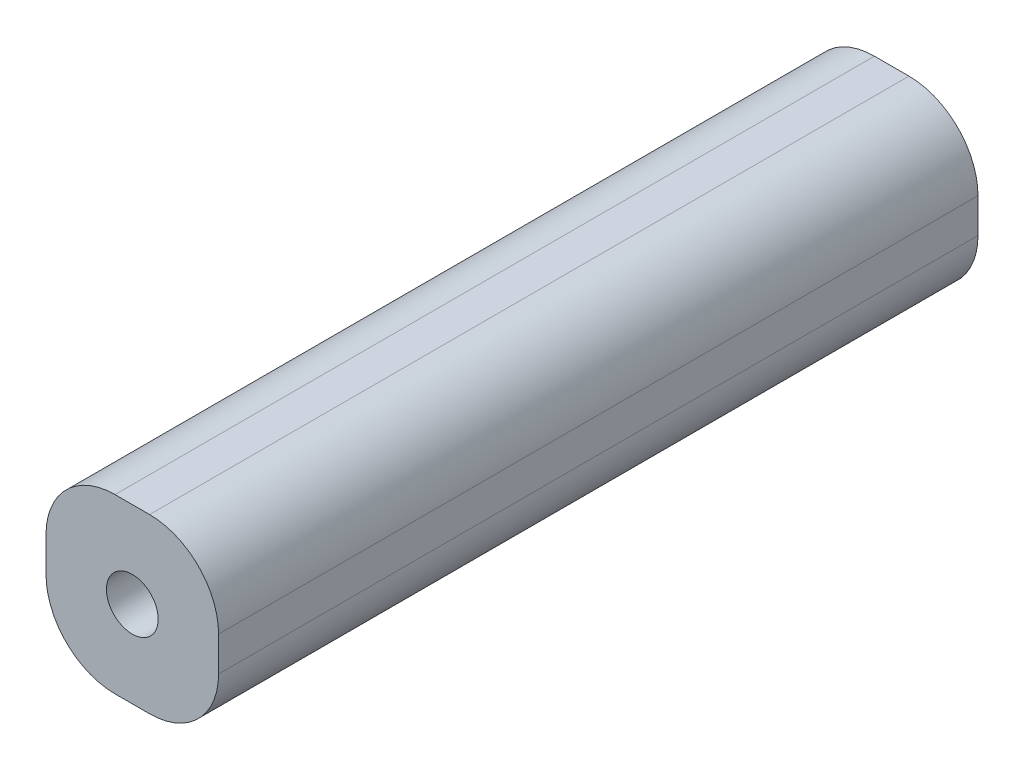
ISO-10303-21;
HEADER;
FILE_DESCRIPTION(('STEP AP214'),'2;1');
FILE_NAME('part.step','',(''),(''),'','','');
FILE_SCHEMA(('AUTOMOTIVE_DESIGN { 1 0 10303 214 1 1 1 1 }'));
ENDSEC;
DATA;
#1=APPLICATION_CONTEXT('core data for automotive mechanical design processes');
#2=APPLICATION_PROTOCOL_DEFINITION('international standard','automotive_design',2000,#1);
#3=PRODUCT_CONTEXT('',#1,'mechanical');
#4=PRODUCT('Part','Part','',(#3));
#5=PRODUCT_RELATED_PRODUCT_CATEGORY('part','',(#4));
#6=PRODUCT_DEFINITION_FORMATION('','',#4);
#7=PRODUCT_DEFINITION_CONTEXT('part definition',#1,'design');
#8=PRODUCT_DEFINITION('design','',#6,#7);
#9=PRODUCT_DEFINITION_SHAPE('','',#8);
#10=(LENGTH_UNIT() NAMED_UNIT(*) SI_UNIT(.MILLI.,.METRE.));
#11=(NAMED_UNIT(*) PLANE_ANGLE_UNIT() SI_UNIT($,.RADIAN.));
#12=(NAMED_UNIT(*) SI_UNIT($,.STERADIAN.) SOLID_ANGLE_UNIT());
#13=UNCERTAINTY_MEASURE_WITH_UNIT(LENGTH_MEASURE(1.E-05),#10,'distance_accuracy_value','');
#14=(GEOMETRIC_REPRESENTATION_CONTEXT(3) GLOBAL_UNCERTAINTY_ASSIGNED_CONTEXT((#13)) GLOBAL_UNIT_ASSIGNED_CONTEXT((#10,
#11,#12)) REPRESENTATION_CONTEXT('',''));
#15=CARTESIAN_POINT('',(0.,0.,0.));
#16=DIRECTION('',(0.,0.,1.));
#17=DIRECTION('',(1.,0.,0.));
#18=AXIS2_PLACEMENT_3D('',#15,#16,#17);
#19=CARTESIAN_POINT('',(0.,0.,44.));
#20=DIRECTION('',(0.,0.,1.));
#21=DIRECTION('',(1.,0.,0.));
#22=AXIS2_PLACEMENT_3D('',#19,#20,#21);
#23=PLANE('',#22);
#24=DIRECTION('',(0.,-1.,0.));
#25=VECTOR('',#24,1.);
#26=CARTESIAN_POINT('',(-6.28000000000001,7.34,44.));
#27=LINE('',#26,#25);
#28=CARTESIAN_POINT('',(-6.28000000000001,3.34,44.));
#29=VERTEX_POINT('',#28);
#30=CARTESIAN_POINT('',(-6.28000000000001,1.34,44.));
#31=VERTEX_POINT('',#30);
#32=EDGE_CURVE('E180',#29,#31,#27,.T.);
#33=ORIENTED_EDGE('',*,*,#32,.T.);
#34=CARTESIAN_POINT('',(-2.28000000000001,1.34,44.));
#35=DIRECTION('',(0.,0.,1.));
#36=DIRECTION('',(1.,0.,0.));
#37=AXIS2_PLACEMENT_3D('',#34,#35,#36);
#38=CIRCLE('',#37,4.);
#39=CARTESIAN_POINT('',(-2.28000000000001,-2.66,44.));
#40=VERTEX_POINT('',#39);
#41=EDGE_CURVE('E168',#31,#40,#38,.T.);
#42=ORIENTED_EDGE('',*,*,#41,.T.);
#43=DIRECTION('',(1.,0.,0.));
#44=VECTOR('',#43,1.);
#45=CARTESIAN_POINT('',(-6.28000000000001,-2.66,44.));
#46=LINE('',#45,#44);
#47=CARTESIAN_POINT('',(-0.280000000000007,-2.66,44.));
#48=VERTEX_POINT('',#47);
#49=EDGE_CURVE('E126',#40,#48,#46,.T.);
#50=ORIENTED_EDGE('',*,*,#49,.T.);
#51=CARTESIAN_POINT('',(-0.280000000000007,1.34,44.));
#52=DIRECTION('',(0.,0.,1.));
#53=DIRECTION('',(1.,0.,0.));
#54=AXIS2_PLACEMENT_3D('',#51,#52,#53);
#55=CIRCLE('',#54,4.);
#56=CARTESIAN_POINT('',(3.71999999999999,1.34,44.));
#57=VERTEX_POINT('',#56);
#58=EDGE_CURVE('E165',#48,#57,#55,.T.);
#59=ORIENTED_EDGE('',*,*,#58,.T.);
#60=DIRECTION('',(0.,1.,0.));
#61=VECTOR('',#60,1.);
#62=CARTESIAN_POINT('',(3.71999999999999,7.34,44.));
#63=LINE('',#62,#61);
#64=CARTESIAN_POINT('',(3.71999999999999,3.34,44.));
#65=VERTEX_POINT('',#64);
#66=EDGE_CURVE('E135',#57,#65,#63,.T.);
#67=ORIENTED_EDGE('',*,*,#66,.T.);
#68=CARTESIAN_POINT('',(-0.280000000000007,3.34,44.));
#69=DIRECTION('',(0.,0.,1.));
#70=DIRECTION('',(1.,0.,0.));
#71=AXIS2_PLACEMENT_3D('',#68,#69,#70);
#72=CIRCLE('',#71,4.);
#73=CARTESIAN_POINT('',(-0.280000000000007,7.34,44.));
#74=VERTEX_POINT('',#73);
#75=EDGE_CURVE('E60',#65,#74,#72,.T.);
#76=ORIENTED_EDGE('',*,*,#75,.T.);
#77=DIRECTION('',(-1.,0.,0.));
#78=VECTOR('',#77,1.);
#79=CARTESIAN_POINT('',(-6.28000000000001,7.34,44.));
#80=LINE('',#79,#78);
#81=CARTESIAN_POINT('',(-2.28000000000001,7.34,44.));
#82=VERTEX_POINT('',#81);
#83=EDGE_CURVE('E140',#74,#82,#80,.T.);
#84=ORIENTED_EDGE('',*,*,#83,.T.);
#85=CARTESIAN_POINT('',(-2.28000000000001,3.34,44.));
#86=DIRECTION('',(0.,0.,1.));
#87=DIRECTION('',(1.,0.,0.));
#88=AXIS2_PLACEMENT_3D('',#85,#86,#87);
#89=CIRCLE('',#88,4.);
#90=EDGE_CURVE('E160',#82,#29,#89,.T.);
#91=ORIENTED_EDGE('',*,*,#90,.T.);
#92=EDGE_LOOP('',(#33,#42,#50,#59,#67,#76,#84,#91));
#93=FACE_BOUND('',#92,.T.);
#94=CARTESIAN_POINT('',(-1.28000000000001,2.34,44.));
#95=DIRECTION('',(0.,0.,1.));
#96=DIRECTION('',(1.,0.,0.));
#97=AXIS2_PLACEMENT_3D('',#94,#95,#96);
#98=CIRCLE('',#97,1.5);
#99=CARTESIAN_POINT('',(0.219999999999993,2.34,44.));
#100=VERTEX_POINT('',#99);
#101=EDGE_CURVE('E192',#100,#100,#98,.T.);
#102=ORIENTED_EDGE('',*,*,#101,.F.);
#103=EDGE_LOOP('',(#102));
#104=FACE_BOUND('',#103,.T.);
#105=ADVANCED_FACE('F38',(#93,#104),#23,.T.);
#106=CARTESIAN_POINT('',(0.,0.,0.));
#107=DIRECTION('',(0.,0.,1.));
#108=DIRECTION('',(1.,0.,0.));
#109=AXIS2_PLACEMENT_3D('',#106,#107,#108);
#110=PLANE('',#109);
#111=DIRECTION('',(1.,0.,0.));
#112=VECTOR('',#111,1.);
#113=CARTESIAN_POINT('',(-6.28000000000001,-2.66,0.));
#114=LINE('',#113,#112);
#115=CARTESIAN_POINT('',(-2.28000000000001,-2.66,0.));
#116=VERTEX_POINT('',#115);
#117=CARTESIAN_POINT('',(-0.280000000000007,-2.66,0.));
#118=VERTEX_POINT('',#117);
#119=EDGE_CURVE('E123',#116,#118,#114,.T.);
#120=ORIENTED_EDGE('',*,*,#119,.F.);
#121=CARTESIAN_POINT('',(-2.28000000000001,1.34,0.));
#122=DIRECTION('',(0.,0.,1.));
#123=DIRECTION('',(1.,0.,0.));
#124=AXIS2_PLACEMENT_3D('',#121,#122,#123);
#125=CIRCLE('',#124,4.);
#126=CARTESIAN_POINT('',(-6.28000000000001,1.34,0.));
#127=VERTEX_POINT('',#126);
#128=EDGE_CURVE('E105',#116,#127,#125,.F.);
#129=ORIENTED_EDGE('',*,*,#128,.T.);
#130=DIRECTION('',(0.,-1.,0.));
#131=VECTOR('',#130,1.);
#132=CARTESIAN_POINT('',(-6.28000000000001,7.34,0.));
#133=LINE('',#132,#131);
#134=CARTESIAN_POINT('',(-6.28000000000001,3.34,0.));
#135=VERTEX_POINT('',#134);
#136=EDGE_CURVE('E136',#135,#127,#133,.T.);
#137=ORIENTED_EDGE('',*,*,#136,.F.);
#138=CARTESIAN_POINT('',(-2.28000000000001,3.34,0.));
#139=DIRECTION('',(0.,0.,1.));
#140=DIRECTION('',(1.,0.,0.));
#141=AXIS2_PLACEMENT_3D('',#138,#139,#140);
#142=CIRCLE('',#141,4.);
#143=CARTESIAN_POINT('',(-2.28000000000001,7.34,0.));
#144=VERTEX_POINT('',#143);
#145=EDGE_CURVE('E128',#135,#144,#142,.F.);
#146=ORIENTED_EDGE('',*,*,#145,.T.);
#147=DIRECTION('',(-1.,0.,0.));
#148=VECTOR('',#147,1.);
#149=CARTESIAN_POINT('',(-6.28000000000001,7.34,0.));
#150=LINE('',#149,#148);
#151=CARTESIAN_POINT('',(-0.280000000000007,7.34,0.));
#152=VERTEX_POINT('',#151);
#153=EDGE_CURVE('E142',#152,#144,#150,.T.);
#154=ORIENTED_EDGE('',*,*,#153,.F.);
#155=CARTESIAN_POINT('',(-0.280000000000007,3.34,0.));
#156=DIRECTION('',(0.,0.,1.));
#157=DIRECTION('',(1.,0.,0.));
#158=AXIS2_PLACEMENT_3D('',#155,#156,#157);
#159=CIRCLE('',#158,4.);
#160=CARTESIAN_POINT('',(3.71999999999999,3.34,0.));
#161=VERTEX_POINT('',#160);
#162=EDGE_CURVE('E150',#152,#161,#159,.F.);
#163=ORIENTED_EDGE('',*,*,#162,.T.);
#164=DIRECTION('',(0.,1.,0.));
#165=VECTOR('',#164,1.);
#166=CARTESIAN_POINT('',(3.71999999999999,7.34,0.));
#167=LINE('',#166,#165);
#168=CARTESIAN_POINT('',(3.71999999999999,1.34,0.));
#169=VERTEX_POINT('',#168);
#170=EDGE_CURVE('E189',#169,#161,#167,.T.);
#171=ORIENTED_EDGE('',*,*,#170,.F.);
#172=CARTESIAN_POINT('',(-0.280000000000007,1.34,0.));
#173=DIRECTION('',(0.,0.,1.));
#174=DIRECTION('',(1.,0.,0.));
#175=AXIS2_PLACEMENT_3D('',#172,#173,#174);
#176=CIRCLE('',#175,4.);
#177=EDGE_CURVE('E117',#169,#118,#176,.F.);
#178=ORIENTED_EDGE('',*,*,#177,.T.);
#179=EDGE_LOOP('',(#120,#129,#137,#146,#154,#163,#171,#178));
#180=FACE_BOUND('',#179,.T.);
#181=CARTESIAN_POINT('',(-1.28000000000001,2.34,0.));
#182=DIRECTION('',(0.,0.,1.));
#183=DIRECTION('',(1.,0.,0.));
#184=AXIS2_PLACEMENT_3D('',#181,#182,#183);
#185=CIRCLE('',#184,1.5);
#186=CARTESIAN_POINT('',(0.219999999999993,2.34,0.));
#187=VERTEX_POINT('',#186);
#188=EDGE_CURVE('E233',#187,#187,#185,.T.);
#189=ORIENTED_EDGE('',*,*,#188,.T.);
#190=EDGE_LOOP('',(#189));
#191=FACE_BOUND('',#190,.T.);
#192=ADVANCED_FACE('F131',(#180,#191),#110,.F.);
#193=CARTESIAN_POINT('',(3.71999999999999,7.34,44.));
#194=DIRECTION('',(-1.,0.,0.));
#195=DIRECTION('',(0.,-1.,0.));
#196=AXIS2_PLACEMENT_3D('',#193,#194,#195);
#197=PLANE('',#196);
#198=ORIENTED_EDGE('',*,*,#66,.F.);
#199=DIRECTION('',(0.,0.,-1.));
#200=VECTOR('',#199,1.);
#201=CARTESIAN_POINT('',(3.71999999999999,1.34,44.));
#202=LINE('',#201,#200);
#203=EDGE_CURVE('E174',#57,#169,#202,.T.);
#204=ORIENTED_EDGE('',*,*,#203,.T.);
#205=ORIENTED_EDGE('',*,*,#170,.T.);
#206=DIRECTION('',(0.,0.,-1.));
#207=VECTOR('',#206,1.);
#208=CARTESIAN_POINT('',(3.71999999999999,3.34,44.));
#209=LINE('',#208,#207);
#210=EDGE_CURVE('E171',#161,#65,#209,.F.);
#211=ORIENTED_EDGE('',*,*,#210,.T.);
#212=EDGE_LOOP('',(#198,#204,#205,#211));
#213=FACE_BOUND('',#212,.T.);
#214=ADVANCED_FACE('F211',(#213),#197,.F.);
#215=CARTESIAN_POINT('',(-6.28000000000001,7.34,44.));
#216=DIRECTION('',(0.,-1.,0.));
#217=DIRECTION('',(0.,0.,-1.));
#218=AXIS2_PLACEMENT_3D('',#215,#216,#217);
#219=PLANE('',#218);
#220=ORIENTED_EDGE('',*,*,#83,.F.);
#221=DIRECTION('',(0.,0.,-1.));
#222=VECTOR('',#221,1.);
#223=CARTESIAN_POINT('',(-0.280000000000007,7.34,44.));
#224=LINE('',#223,#222);
#225=EDGE_CURVE('E11',#74,#152,#224,.T.);
#226=ORIENTED_EDGE('',*,*,#225,.T.);
#227=ORIENTED_EDGE('',*,*,#153,.T.);
#228=DIRECTION('',(0.,0.,-1.));
#229=VECTOR('',#228,1.);
#230=CARTESIAN_POINT('',(-2.28000000000001,7.34,44.));
#231=LINE('',#230,#229);
#232=EDGE_CURVE('E47',#144,#82,#231,.F.);
#233=ORIENTED_EDGE('',*,*,#232,.T.);
#234=EDGE_LOOP('',(#220,#226,#227,#233));
#235=FACE_BOUND('',#234,.T.);
#236=ADVANCED_FACE('F195',(#235),#219,.F.);
#237=CARTESIAN_POINT('',(-6.28000000000001,7.34,44.));
#238=DIRECTION('',(1.,0.,0.));
#239=DIRECTION('',(0.,1.,0.));
#240=AXIS2_PLACEMENT_3D('',#237,#238,#239);
#241=PLANE('',#240);
#242=ORIENTED_EDGE('',*,*,#136,.T.);
#243=DIRECTION('',(0.,0.,-1.));
#244=VECTOR('',#243,1.);
#245=CARTESIAN_POINT('',(-6.28000000000001,1.34,44.));
#246=LINE('',#245,#244);
#247=EDGE_CURVE('E110',#127,#31,#246,.F.);
#248=ORIENTED_EDGE('',*,*,#247,.T.);
#249=ORIENTED_EDGE('',*,*,#32,.F.);
#250=DIRECTION('',(0.,0.,-1.));
#251=VECTOR('',#250,1.);
#252=CARTESIAN_POINT('',(-6.28000000000001,3.34,44.));
#253=LINE('',#252,#251);
#254=EDGE_CURVE('E116',#29,#135,#253,.T.);
#255=ORIENTED_EDGE('',*,*,#254,.T.);
#256=EDGE_LOOP('',(#242,#248,#249,#255));
#257=FACE_BOUND('',#256,.T.);
#258=ADVANCED_FACE('F202',(#257),#241,.F.);
#259=CARTESIAN_POINT('',(-6.28000000000001,-2.66,44.));
#260=DIRECTION('',(0.,1.,0.));
#261=DIRECTION('',(0.,0.,1.));
#262=AXIS2_PLACEMENT_3D('',#259,#260,#261);
#263=PLANE('',#262);
#264=ORIENTED_EDGE('',*,*,#49,.F.);
#265=DIRECTION('',(0.,0.,-1.));
#266=VECTOR('',#265,1.);
#267=CARTESIAN_POINT('',(-2.28000000000001,-2.66,44.));
#268=LINE('',#267,#266);
#269=EDGE_CURVE('E109',#40,#116,#268,.T.);
#270=ORIENTED_EDGE('',*,*,#269,.T.);
#271=ORIENTED_EDGE('',*,*,#119,.T.);
#272=DIRECTION('',(0.,0.,-1.));
#273=VECTOR('',#272,1.);
#274=CARTESIAN_POINT('',(-0.280000000000007,-2.66,44.));
#275=LINE('',#274,#273);
#276=EDGE_CURVE('E129',#118,#48,#275,.F.);
#277=ORIENTED_EDGE('',*,*,#276,.T.);
#278=EDGE_LOOP('',(#264,#270,#271,#277));
#279=FACE_BOUND('',#278,.T.);
#280=ADVANCED_FACE('F122',(#279),#263,.F.);
#281=CARTESIAN_POINT('',(-1.28000000000001,2.34,44.));
#282=DIRECTION('',(0.,0.,-1.));
#283=DIRECTION('',(-1.,0.,0.));
#284=AXIS2_PLACEMENT_3D('',#281,#282,#283);
#285=CYLINDRICAL_SURFACE('',#284,1.5);
#286=ORIENTED_EDGE('',*,*,#101,.T.);
#287=EDGE_LOOP('',(#286));
#288=FACE_BOUND('',#287,.T.);
#289=ORIENTED_EDGE('',*,*,#188,.F.);
#290=EDGE_LOOP('',(#289));
#291=FACE_BOUND('',#290,.T.);
#292=ADVANCED_FACE('F209',(#288,#291),#285,.F.);
#293=CARTESIAN_POINT('',(-2.28000000000001,1.34,44.));
#294=DIRECTION('',(0.,0.,-1.));
#295=DIRECTION('',(-1.,0.,0.));
#296=AXIS2_PLACEMENT_3D('',#293,#294,#295);
#297=CYLINDRICAL_SURFACE('',#296,4.);
#298=ORIENTED_EDGE('',*,*,#41,.F.);
#299=ORIENTED_EDGE('',*,*,#247,.F.);
#300=ORIENTED_EDGE('',*,*,#128,.F.);
#301=ORIENTED_EDGE('',*,*,#269,.F.);
#302=EDGE_LOOP('',(#298,#299,#300,#301));
#303=FACE_BOUND('',#302,.T.);
#304=ADVANCED_FACE('F108',(#303),#297,.T.);
#305=CARTESIAN_POINT('',(-0.280000000000007,1.34,44.));
#306=DIRECTION('',(0.,0.,-1.));
#307=DIRECTION('',(-1.,0.,0.));
#308=AXIS2_PLACEMENT_3D('',#305,#306,#307);
#309=CYLINDRICAL_SURFACE('',#308,4.);
#310=ORIENTED_EDGE('',*,*,#58,.F.);
#311=ORIENTED_EDGE('',*,*,#276,.F.);
#312=ORIENTED_EDGE('',*,*,#177,.F.);
#313=ORIENTED_EDGE('',*,*,#203,.F.);
#314=EDGE_LOOP('',(#310,#311,#312,#313));
#315=FACE_BOUND('',#314,.T.);
#316=ADVANCED_FACE('F226',(#315),#309,.T.);
#317=CARTESIAN_POINT('',(-0.280000000000007,3.34,44.));
#318=DIRECTION('',(0.,0.,-1.));
#319=DIRECTION('',(-1.,0.,0.));
#320=AXIS2_PLACEMENT_3D('',#317,#318,#319);
#321=CYLINDRICAL_SURFACE('',#320,4.);
#322=ORIENTED_EDGE('',*,*,#75,.F.);
#323=ORIENTED_EDGE('',*,*,#210,.F.);
#324=ORIENTED_EDGE('',*,*,#162,.F.);
#325=ORIENTED_EDGE('',*,*,#225,.F.);
#326=EDGE_LOOP('',(#322,#323,#324,#325));
#327=FACE_BOUND('',#326,.T.);
#328=ADVANCED_FACE('F240',(#327),#321,.T.);
#329=CARTESIAN_POINT('',(-2.28000000000001,3.34,44.));
#330=DIRECTION('',(0.,0.,-1.));
#331=DIRECTION('',(-1.,0.,0.));
#332=AXIS2_PLACEMENT_3D('',#329,#330,#331);
#333=CYLINDRICAL_SURFACE('',#332,4.);
#334=ORIENTED_EDGE('',*,*,#90,.F.);
#335=ORIENTED_EDGE('',*,*,#232,.F.);
#336=ORIENTED_EDGE('',*,*,#145,.F.);
#337=ORIENTED_EDGE('',*,*,#254,.F.);
#338=EDGE_LOOP('',(#334,#335,#336,#337));
#339=FACE_BOUND('',#338,.T.);
#340=ADVANCED_FACE('F40',(#339),#333,.T.);
#341=CLOSED_SHELL('',(#105,#192,#214,#236,#258,#280,#292,#304,#316,#328,#340));
#342=MANIFOLD_SOLID_BREP('B2',#341);
#343=ADVANCED_BREP_SHAPE_REPRESENTATION('',(#18,#342),#14);
#344=SHAPE_DEFINITION_REPRESENTATION(#9,#343);
ENDSEC;
END-ISO-10303-21;
